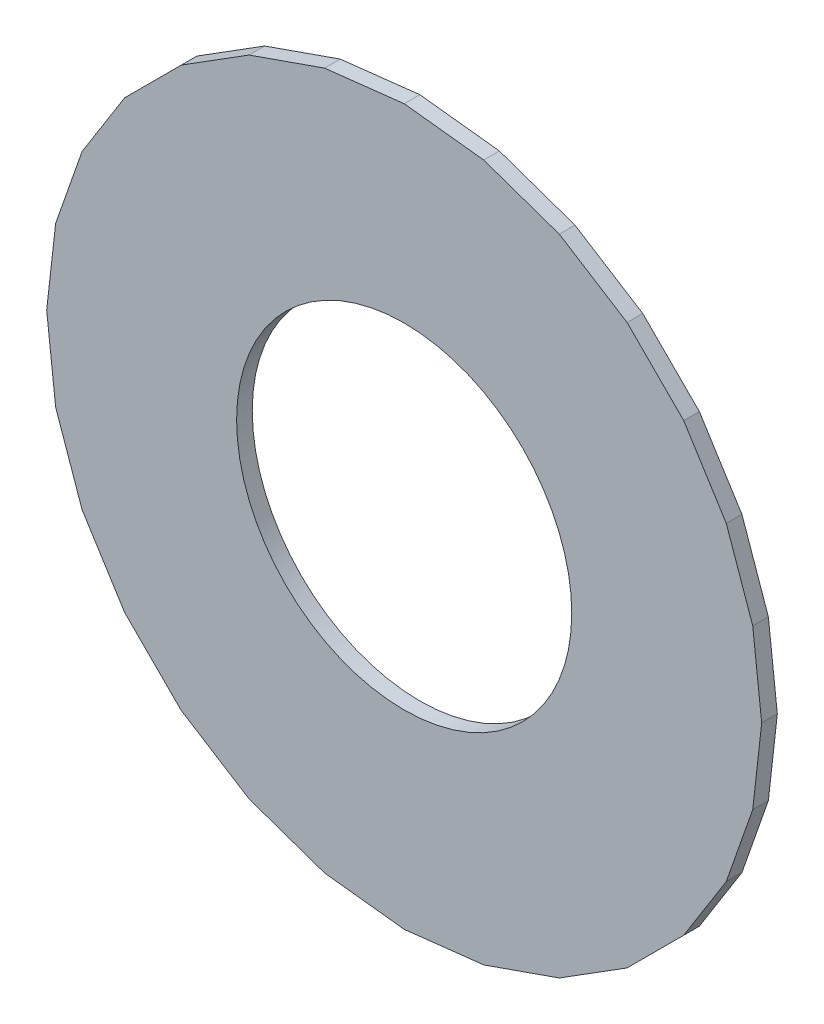
ISO-10303-21;
HEADER;
FILE_DESCRIPTION(('STEP AP214'),'2;1');
FILE_NAME('part.step','',(''),(''),'','','');
FILE_SCHEMA(('AUTOMOTIVE_DESIGN { 1 0 10303 214 1 1 1 1 }'));
ENDSEC;
DATA;
#1=APPLICATION_CONTEXT('core data for automotive mechanical design processes');
#2=APPLICATION_PROTOCOL_DEFINITION('international standard','automotive_design',2000,#1);
#3=PRODUCT_CONTEXT('',#1,'mechanical');
#4=PRODUCT('Part','Part','',(#3));
#5=PRODUCT_RELATED_PRODUCT_CATEGORY('part','',(#4));
#6=PRODUCT_DEFINITION_FORMATION('','',#4);
#7=PRODUCT_DEFINITION_CONTEXT('part definition',#1,'design');
#8=PRODUCT_DEFINITION('design','',#6,#7);
#9=PRODUCT_DEFINITION_SHAPE('','',#8);
#10=(LENGTH_UNIT() NAMED_UNIT(*) SI_UNIT(.MILLI.,.METRE.));
#11=(NAMED_UNIT(*) PLANE_ANGLE_UNIT() SI_UNIT($,.RADIAN.));
#12=(NAMED_UNIT(*) SI_UNIT($,.STERADIAN.) SOLID_ANGLE_UNIT());
#13=UNCERTAINTY_MEASURE_WITH_UNIT(LENGTH_MEASURE(1.E-05),#10,'distance_accuracy_value','');
#14=(GEOMETRIC_REPRESENTATION_CONTEXT(3) GLOBAL_UNCERTAINTY_ASSIGNED_CONTEXT((#13)) GLOBAL_UNIT_ASSIGNED_CONTEXT((#10,
#11,#12)) REPRESENTATION_CONTEXT('',''));
#15=CARTESIAN_POINT('',(0.,0.,0.));
#16=DIRECTION('',(0.,0.,1.));
#17=DIRECTION('',(1.,0.,0.));
#18=AXIS2_PLACEMENT_3D('',#15,#16,#17);
#19=CARTESIAN_POINT('',(166.497,-143.637,-0.045));
#20=DIRECTION('',(0.,0.,-1.));
#21=DIRECTION('',(0.,-1.,0.));
#22=AXIS2_PLACEMENT_3D('',#19,#20,#21);
#23=CYLINDRICAL_SURFACE('',#22,0.375);
#24=CARTESIAN_POINT('',(166.497,-143.637,-0.035));
#25=DIRECTION('',(0.,0.,-1.));
#26=DIRECTION('',(0.,-1.,0.));
#27=AXIS2_PLACEMENT_3D('',#24,#25,#26);
#28=CIRCLE('',#27,0.375);
#29=CARTESIAN_POINT('',(166.497,-144.012,-0.035));
#30=VERTEX_POINT('',#29);
#31=EDGE_CURVE('E403',#30,#30,#28,.T.);
#32=ORIENTED_EDGE('',*,*,#31,.T.);
#33=DIRECTION('',(0.,0.,1.));
#34=VECTOR('',#33,1.);
#35=CARTESIAN_POINT('',(166.497,-144.012,-0.045));
#36=LINE('',#35,#34);
#37=CARTESIAN_POINT('',(166.497,-144.012,0.));
#38=VERTEX_POINT('',#37);
#39=EDGE_CURVE('E11',#30,#38,#36,.T.);
#40=ORIENTED_EDGE('',*,*,#39,.T.);
#41=CARTESIAN_POINT('',(166.497,-143.637,0.));
#42=DIRECTION('',(0.,0.,-1.));
#43=DIRECTION('',(0.,-1.,0.));
#44=AXIS2_PLACEMENT_3D('',#41,#42,#43);
#45=CIRCLE('',#44,0.375);
#46=EDGE_CURVE('E503',#38,#38,#45,.T.);
#47=ORIENTED_EDGE('',*,*,#46,.F.);
#48=ORIENTED_EDGE('',*,*,#39,.F.);
#49=EDGE_LOOP('',(#32,#40,#47,#48));
#50=FACE_BOUND('',#49,.T.);
#51=ADVANCED_FACE('F17',(#50),#23,.F.);
#52=CARTESIAN_POINT('',(166.318983,-144.416942,-0.035));
#53=DIRECTION('',(-0.330278315977027,-0.943883591337077,0.));
#54=DIRECTION('',(-0.943883591337077,0.330278315977027,0.));
#55=AXIS2_PLACEMENT_3D('',#52,#53,#54);
#56=PLANE('',#55);
#57=DIRECTION('',(0.,0.,1.));
#58=VECTOR('',#57,1.);
#59=CARTESIAN_POINT('',(166.318983,-144.416942,-0.035));
#60=LINE('',#59,#58);
#61=CARTESIAN_POINT('',(166.318983,-144.416942,-0.035));
#62=VERTEX_POINT('',#61);
#63=CARTESIAN_POINT('',(166.318983,-144.416942,0.));
#64=VERTEX_POINT('',#63);
#65=EDGE_CURVE('E25',#62,#64,#60,.T.);
#66=ORIENTED_EDGE('',*,*,#65,.T.);
#67=DIRECTION('',(-0.943883591337077,0.330278315977027,0.));
#68=VECTOR('',#67,1.);
#69=CARTESIAN_POINT('',(166.318983,-144.416942,0.));
#70=LINE('',#69,#68);
#71=CARTESIAN_POINT('',(166.149893,-144.357775,0.));
#72=VERTEX_POINT('',#71);
#73=EDGE_CURVE('E471',#64,#72,#70,.T.);
#74=ORIENTED_EDGE('',*,*,#73,.T.);
#75=DIRECTION('',(0.,0.,1.));
#76=VECTOR('',#75,1.);
#77=CARTESIAN_POINT('',(166.149893,-144.357775,-0.035));
#78=LINE('',#77,#76);
#79=CARTESIAN_POINT('',(166.149893,-144.357775,-0.035));
#80=VERTEX_POINT('',#79);
#81=EDGE_CURVE('E535',#80,#72,#78,.T.);
#82=ORIENTED_EDGE('',*,*,#81,.F.);
#83=DIRECTION('',(-0.943883591337077,0.330278315977027,0.));
#84=VECTOR('',#83,1.);
#85=CARTESIAN_POINT('',(166.318983,-144.416942,-0.035));
#86=LINE('',#85,#84);
#87=EDGE_CURVE('E365',#62,#80,#86,.T.);
#88=ORIENTED_EDGE('',*,*,#87,.F.);
#89=EDGE_LOOP('',(#66,#74,#82,#88));
#90=FACE_BOUND('',#89,.T.);
#91=ADVANCED_FACE('F542',(#90),#56,.T.);
#92=CARTESIAN_POINT('',(166.497,-144.437,-0.035));
#93=DIRECTION('',(-0.111966136678988,-0.993712022789894,0.));
#94=DIRECTION('',(-0.993712022789894,0.111966136678988,0.));
#95=AXIS2_PLACEMENT_3D('',#92,#93,#94);
#96=PLANE('',#95);
#97=DIRECTION('',(0.,0.,1.));
#98=VECTOR('',#97,1.);
#99=CARTESIAN_POINT('',(166.497,-144.437,-0.035));
#100=LINE('',#99,#98);
#101=CARTESIAN_POINT('',(166.497,-144.437,-0.035));
#102=VERTEX_POINT('',#101);
#103=CARTESIAN_POINT('',(166.497,-144.437,0.));
#104=VERTEX_POINT('',#103);
#105=EDGE_CURVE('E532',#102,#104,#100,.T.);
#106=ORIENTED_EDGE('',*,*,#105,.T.);
#107=DIRECTION('',(-0.993712022789894,0.111966136678988,0.));
#108=VECTOR('',#107,1.);
#109=CARTESIAN_POINT('',(166.497,-144.437,0.));
#110=LINE('',#109,#108);
#111=EDGE_CURVE('E475',#104,#64,#110,.T.);
#112=ORIENTED_EDGE('',*,*,#111,.T.);
#113=ORIENTED_EDGE('',*,*,#65,.F.);
#114=DIRECTION('',(-0.993712022789894,0.111966136678988,0.));
#115=VECTOR('',#114,1.);
#116=CARTESIAN_POINT('',(166.497,-144.437,-0.035));
#117=LINE('',#116,#115);
#118=EDGE_CURVE('E361',#102,#62,#117,.T.);
#119=ORIENTED_EDGE('',*,*,#118,.F.);
#120=EDGE_LOOP('',(#106,#112,#113,#119));
#121=FACE_BOUND('',#120,.T.);
#122=ADVANCED_FACE('F548',(#121),#96,.T.);
#123=CARTESIAN_POINT('',(166.149893,-144.357775,-0.035));
#124=DIRECTION('',(-0.532032066600227,-0.846724205458361,0.));
#125=DIRECTION('',(-0.846724205458361,0.532032066600227,0.));
#126=AXIS2_PLACEMENT_3D('',#123,#124,#125);
#127=PLANE('',#126);
#128=ORIENTED_EDGE('',*,*,#81,.T.);
#129=DIRECTION('',(-0.846724205458361,0.532032066600227,0.));
#130=VECTOR('',#129,1.);
#131=CARTESIAN_POINT('',(166.149893,-144.357775,0.));
#132=LINE('',#131,#130);
#133=CARTESIAN_POINT('',(165.998208,-144.262465,0.));
#134=VERTEX_POINT('',#133);
#135=EDGE_CURVE('E467',#72,#134,#132,.T.);
#136=ORIENTED_EDGE('',*,*,#135,.T.);
#137=DIRECTION('',(0.,0.,1.));
#138=VECTOR('',#137,1.);
#139=CARTESIAN_POINT('',(165.998208,-144.262465,-0.035));
#140=LINE('',#139,#138);
#141=CARTESIAN_POINT('',(165.998208,-144.262465,-0.035));
#142=VERTEX_POINT('',#141);
#143=EDGE_CURVE('E529',#142,#134,#140,.T.);
#144=ORIENTED_EDGE('',*,*,#143,.F.);
#145=DIRECTION('',(-0.846724205458361,0.532032066600227,0.));
#146=VECTOR('',#145,1.);
#147=CARTESIAN_POINT('',(166.149893,-144.357775,-0.035));
#148=LINE('',#147,#146);
#149=EDGE_CURVE('E372',#80,#142,#148,.T.);
#150=ORIENTED_EDGE('',*,*,#149,.F.);
#151=EDGE_LOOP('',(#128,#136,#144,#150));
#152=FACE_BOUND('',#151,.T.);
#153=ADVANCED_FACE('F557',(#152),#127,.T.);
#154=CARTESIAN_POINT('',(166.675017,-144.416942,-0.035));
#155=DIRECTION('',(0.111966136678988,-0.993712022789894,0.));
#156=DIRECTION('',(0.,0.,-1.));
#157=AXIS2_PLACEMENT_3D('',#154,#155,#156);
#158=PLANE('',#157);
#159=DIRECTION('',(0.,0.,1.));
#160=VECTOR('',#159,1.);
#161=CARTESIAN_POINT('',(166.675017,-144.416942,-0.035));
#162=LINE('',#161,#160);
#163=CARTESIAN_POINT('',(166.675017,-144.416942,-0.035));
#164=VERTEX_POINT('',#163);
#165=CARTESIAN_POINT('',(166.675017,-144.416942,0.));
#166=VERTEX_POINT('',#165);
#167=EDGE_CURVE('E526',#164,#166,#162,.T.);
#168=ORIENTED_EDGE('',*,*,#167,.T.);
#169=DIRECTION('',(-0.993712022789894,-0.111966136678988,0.));
#170=VECTOR('',#169,1.);
#171=CARTESIAN_POINT('',(166.675017,-144.416942,0.));
#172=LINE('',#171,#170);
#173=EDGE_CURVE('E483',#166,#104,#172,.T.);
#174=ORIENTED_EDGE('',*,*,#173,.T.);
#175=ORIENTED_EDGE('',*,*,#105,.F.);
#176=DIRECTION('',(-0.993712022789894,-0.111966136678988,0.));
#177=VECTOR('',#176,1.);
#178=CARTESIAN_POINT('',(166.675017,-144.416942,-0.035));
#179=LINE('',#178,#177);
#180=EDGE_CURVE('E360',#164,#102,#179,.T.);
#181=ORIENTED_EDGE('',*,*,#180,.F.);
#182=EDGE_LOOP('',(#168,#174,#175,#181));
#183=FACE_BOUND('',#182,.T.);
#184=ADVANCED_FACE('F563',(#183),#158,.T.);
#185=CARTESIAN_POINT('',(165.998208,-144.262465,-0.035));
#186=DIRECTION('',(-0.707106781186048,-0.707106781187048,0.));
#187=DIRECTION('',(-0.707106781187048,0.707106781186048,0.));
#188=AXIS2_PLACEMENT_3D('',#185,#186,#187);
#189=PLANE('',#188);
#190=ORIENTED_EDGE('',*,*,#143,.T.);
#191=DIRECTION('',(-0.707106781187048,0.707106781186048,0.));
#192=VECTOR('',#191,1.);
#193=CARTESIAN_POINT('',(165.998208,-144.262465,0.));
#194=LINE('',#193,#192);
#195=CARTESIAN_POINT('',(165.871535,-144.135792,0.));
#196=VERTEX_POINT('',#195);
#197=EDGE_CURVE('E355',#134,#196,#194,.T.);
#198=ORIENTED_EDGE('',*,*,#197,.T.);
#199=DIRECTION('',(0.,0.,1.));
#200=VECTOR('',#199,1.);
#201=CARTESIAN_POINT('',(165.871535,-144.135792,-0.035));
#202=LINE('',#201,#200);
#203=CARTESIAN_POINT('',(165.871535,-144.135792,-0.035));
#204=VERTEX_POINT('',#203);
#205=EDGE_CURVE('E479',#204,#196,#202,.T.);
#206=ORIENTED_EDGE('',*,*,#205,.F.);
#207=DIRECTION('',(-0.707106781187048,0.707106781186048,0.));
#208=VECTOR('',#207,1.);
#209=CARTESIAN_POINT('',(165.998208,-144.262465,-0.035));
#210=LINE('',#209,#208);
#211=EDGE_CURVE('E376',#142,#204,#210,.T.);
#212=ORIENTED_EDGE('',*,*,#211,.F.);
#213=EDGE_LOOP('',(#190,#198,#206,#212));
#214=FACE_BOUND('',#213,.T.);
#215=ADVANCED_FACE('F933',(#214),#189,.T.);
#216=CARTESIAN_POINT('',(166.844107,-144.357775,-0.035));
#217=DIRECTION('',(0.330278315977027,-0.943883591337077,0.));
#218=DIRECTION('',(0.,0.,-1.));
#219=AXIS2_PLACEMENT_3D('',#216,#217,#218);
#220=PLANE('',#219);
#221=DIRECTION('',(0.,0.,1.));
#222=VECTOR('',#221,1.);
#223=CARTESIAN_POINT('',(166.844107,-144.357775,-0.035));
#224=LINE('',#223,#222);
#225=CARTESIAN_POINT('',(166.844107,-144.357775,-0.035));
#226=VERTEX_POINT('',#225);
#227=CARTESIAN_POINT('',(166.844107,-144.357775,0.));
#228=VERTEX_POINT('',#227);
#229=EDGE_CURVE('E476',#226,#228,#224,.T.);
#230=ORIENTED_EDGE('',*,*,#229,.T.);
#231=DIRECTION('',(-0.943883591337077,-0.330278315977027,0.));
#232=VECTOR('',#231,1.);
#233=CARTESIAN_POINT('',(166.844107,-144.357775,0.));
#234=LINE('',#233,#232);
#235=EDGE_CURVE('E454',#228,#166,#234,.T.);
#236=ORIENTED_EDGE('',*,*,#235,.T.);
#237=ORIENTED_EDGE('',*,*,#167,.F.);
#238=DIRECTION('',(-0.943883591337077,-0.330278315977027,0.));
#239=VECTOR('',#238,1.);
#240=CARTESIAN_POINT('',(166.844107,-144.357775,-0.035));
#241=LINE('',#240,#239);
#242=EDGE_CURVE('E350',#226,#164,#241,.T.);
#243=ORIENTED_EDGE('',*,*,#242,.F.);
#244=EDGE_LOOP('',(#230,#236,#237,#243));
#245=FACE_BOUND('',#244,.T.);
#246=ADVANCED_FACE('F927',(#245),#220,.T.);
#247=CARTESIAN_POINT('',(165.871535,-144.135792,-0.035));
#248=DIRECTION('',(-0.846724205458361,-0.532032066600227,0.));
#249=DIRECTION('',(-0.532032066600227,0.846724205458361,0.));
#250=AXIS2_PLACEMENT_3D('',#247,#248,#249);
#251=PLANE('',#250);
#252=ORIENTED_EDGE('',*,*,#205,.T.);
#253=DIRECTION('',(-0.532032066600227,0.846724205458361,0.));
#254=VECTOR('',#253,1.);
#255=CARTESIAN_POINT('',(165.871535,-144.135792,0.));
#256=LINE('',#255,#254);
#257=CARTESIAN_POINT('',(165.776225,-143.984107,0.));
#258=VERTEX_POINT('',#257);
#259=EDGE_CURVE('E351',#196,#258,#256,.T.);
#260=ORIENTED_EDGE('',*,*,#259,.T.);
#261=DIRECTION('',(0.,0.,1.));
#262=VECTOR('',#261,1.);
#263=CARTESIAN_POINT('',(165.776225,-143.984107,-0.035));
#264=LINE('',#263,#262);
#265=CARTESIAN_POINT('',(165.776225,-143.984107,-0.035));
#266=VERTEX_POINT('',#265);
#267=EDGE_CURVE('E427',#266,#258,#264,.T.);
#268=ORIENTED_EDGE('',*,*,#267,.F.);
#269=DIRECTION('',(-0.532032066600227,0.846724205458361,0.));
#270=VECTOR('',#269,1.);
#271=CARTESIAN_POINT('',(165.871535,-144.135792,-0.035));
#272=LINE('',#271,#270);
#273=EDGE_CURVE('E346',#204,#266,#272,.T.);
#274=ORIENTED_EDGE('',*,*,#273,.F.);
#275=EDGE_LOOP('',(#252,#260,#268,#274));
#276=FACE_BOUND('',#275,.T.);
#277=ADVANCED_FACE('F932',(#276),#251,.T.);
#278=CARTESIAN_POINT('',(166.995792,-144.262465,-0.035));
#279=DIRECTION('',(0.532032066600227,-0.846724205458361,0.));
#280=DIRECTION('',(0.,0.,-1.));
#281=AXIS2_PLACEMENT_3D('',#278,#279,#280);
#282=PLANE('',#281);
#283=DIRECTION('',(0.,0.,1.));
#284=VECTOR('',#283,1.);
#285=CARTESIAN_POINT('',(166.995792,-144.262465,-0.035));
#286=LINE('',#285,#284);
#287=CARTESIAN_POINT('',(166.995792,-144.262465,-0.035));
#288=VERTEX_POINT('',#287);
#289=CARTESIAN_POINT('',(166.995792,-144.262465,0.));
#290=VERTEX_POINT('',#289);
#291=EDGE_CURVE('E424',#288,#290,#286,.T.);
#292=ORIENTED_EDGE('',*,*,#291,.T.);
#293=DIRECTION('',(-0.846724205458361,-0.532032066600227,0.));
#294=VECTOR('',#293,1.);
#295=CARTESIAN_POINT('',(166.995792,-144.262465,0.));
#296=LINE('',#295,#294);
#297=EDGE_CURVE('E449',#290,#228,#296,.T.);
#298=ORIENTED_EDGE('',*,*,#297,.T.);
#299=ORIENTED_EDGE('',*,*,#229,.F.);
#300=DIRECTION('',(-0.846724205458361,-0.532032066600227,0.));
#301=VECTOR('',#300,1.);
#302=CARTESIAN_POINT('',(166.995792,-144.262465,-0.035));
#303=LINE('',#302,#301);
#304=EDGE_CURVE('E331',#288,#226,#303,.T.);
#305=ORIENTED_EDGE('',*,*,#304,.F.);
#306=EDGE_LOOP('',(#292,#298,#299,#305));
#307=FACE_BOUND('',#306,.T.);
#308=ADVANCED_FACE('F1002',(#307),#282,.T.);
#309=CARTESIAN_POINT('',(165.776225,-143.984107,-0.035));
#310=DIRECTION('',(-0.943883591336766,-0.330278315977918,0.));
#311=DIRECTION('',(-0.330278315977918,0.943883591336766,0.));
#312=AXIS2_PLACEMENT_3D('',#309,#310,#311);
#313=PLANE('',#312);
#314=ORIENTED_EDGE('',*,*,#267,.T.);
#315=DIRECTION('',(-0.330278315977918,0.943883591336766,0.));
#316=VECTOR('',#315,1.);
#317=CARTESIAN_POINT('',(165.776225,-143.984107,0.));
#318=LINE('',#317,#316);
#319=CARTESIAN_POINT('',(165.717058,-143.815017,0.));
#320=VERTEX_POINT('',#319);
#321=EDGE_CURVE('E356',#258,#320,#318,.T.);
#322=ORIENTED_EDGE('',*,*,#321,.T.);
#323=DIRECTION('',(0.,0.,1.));
#324=VECTOR('',#323,1.);
#325=CARTESIAN_POINT('',(165.717058,-143.815017,-0.035));
#326=LINE('',#325,#324);
#327=CARTESIAN_POINT('',(165.717058,-143.815017,-0.035));
#328=VERTEX_POINT('',#327);
#329=EDGE_CURVE('E335',#328,#320,#326,.T.);
#330=ORIENTED_EDGE('',*,*,#329,.F.);
#331=DIRECTION('',(-0.330278315977918,0.943883591336766,0.));
#332=VECTOR('',#331,1.);
#333=CARTESIAN_POINT('',(165.776225,-143.984107,-0.035));
#334=LINE('',#333,#332);
#335=EDGE_CURVE('E342',#266,#328,#334,.T.);
#336=ORIENTED_EDGE('',*,*,#335,.F.);
#337=EDGE_LOOP('',(#314,#322,#330,#336));
#338=FACE_BOUND('',#337,.T.);
#339=ADVANCED_FACE('F604',(#338),#313,.T.);
#340=CARTESIAN_POINT('',(167.122465,-144.135792,-0.035));
#341=DIRECTION('',(0.707106781186048,-0.707106781187048,0.));
#342=DIRECTION('',(0.,0.,-1.));
#343=AXIS2_PLACEMENT_3D('',#340,#341,#342);
#344=PLANE('',#343);
#345=DIRECTION('',(0.,0.,1.));
#346=VECTOR('',#345,1.);
#347=CARTESIAN_POINT('',(167.122465,-144.135792,-0.035));
#348=LINE('',#347,#346);
#349=CARTESIAN_POINT('',(167.122465,-144.135792,-0.035));
#350=VERTEX_POINT('',#349);
#351=CARTESIAN_POINT('',(167.122465,-144.135792,0.));
#352=VERTEX_POINT('',#351);
#353=EDGE_CURVE('E332',#350,#352,#348,.T.);
#354=ORIENTED_EDGE('',*,*,#353,.T.);
#355=DIRECTION('',(-0.707106781187048,-0.707106781186048,0.));
#356=VECTOR('',#355,1.);
#357=CARTESIAN_POINT('',(167.122465,-144.135792,0.));
#358=LINE('',#357,#356);
#359=EDGE_CURVE('E453',#352,#290,#358,.T.);
#360=ORIENTED_EDGE('',*,*,#359,.T.);
#361=ORIENTED_EDGE('',*,*,#291,.F.);
#362=DIRECTION('',(-0.707106781187048,-0.707106781186048,0.));
#363=VECTOR('',#362,1.);
#364=CARTESIAN_POINT('',(167.122465,-144.135792,-0.035));
#365=LINE('',#364,#363);
#366=EDGE_CURVE('E327',#350,#288,#365,.T.);
#367=ORIENTED_EDGE('',*,*,#366,.F.);
#368=EDGE_LOOP('',(#354,#360,#361,#367));
#369=FACE_BOUND('',#368,.T.);
#370=ADVANCED_FACE('F986',(#369),#344,.T.);
#371=CARTESIAN_POINT('',(165.717058,-143.815017,-0.035));
#372=DIRECTION('',(-0.993712022789894,-0.111966136678988,0.));
#373=DIRECTION('',(-0.111966136678988,0.993712022789894,0.));
#374=AXIS2_PLACEMENT_3D('',#371,#372,#373);
#375=PLANE('',#374);
#376=ORIENTED_EDGE('',*,*,#329,.T.);
#377=DIRECTION('',(-0.111966136678988,0.993712022789894,0.));
#378=VECTOR('',#377,1.);
#379=CARTESIAN_POINT('',(165.717058,-143.815017,0.));
#380=LINE('',#379,#378);
#381=CARTESIAN_POINT('',(165.697,-143.637,0.));
#382=VERTEX_POINT('',#381);
#383=EDGE_CURVE('E443',#320,#382,#380,.T.);
#384=ORIENTED_EDGE('',*,*,#383,.T.);
#385=DIRECTION('',(0.,0.,1.));
#386=VECTOR('',#385,1.);
#387=CARTESIAN_POINT('',(165.697,-143.637,-0.035));
#388=LINE('',#387,#386);
#389=CARTESIAN_POINT('',(165.697,-143.637,-0.035));
#390=VERTEX_POINT('',#389);
#391=EDGE_CURVE('E336',#390,#382,#388,.T.);
#392=ORIENTED_EDGE('',*,*,#391,.F.);
#393=DIRECTION('',(-0.111966136678988,0.993712022789894,0.));
#394=VECTOR('',#393,1.);
#395=CARTESIAN_POINT('',(165.717058,-143.815017,-0.035));
#396=LINE('',#395,#394);
#397=EDGE_CURVE('E313',#328,#390,#396,.T.);
#398=ORIENTED_EDGE('',*,*,#397,.F.);
#399=EDGE_LOOP('',(#376,#384,#392,#398));
#400=FACE_BOUND('',#399,.T.);
#401=ADVANCED_FACE('F598',(#400),#375,.T.);
#402=CARTESIAN_POINT('',(167.217775,-143.984107,-0.035));
#403=DIRECTION('',(0.846724205458361,-0.532032066600227,0.));
#404=DIRECTION('',(0.,0.,-1.));
#405=AXIS2_PLACEMENT_3D('',#402,#403,#404);
#406=PLANE('',#405);
#407=DIRECTION('',(0.,0.,1.));
#408=VECTOR('',#407,1.);
#409=CARTESIAN_POINT('',(167.217775,-143.984107,-0.035));
#410=LINE('',#409,#408);
#411=CARTESIAN_POINT('',(167.217775,-143.984107,-0.035));
#412=VERTEX_POINT('',#411);
#413=CARTESIAN_POINT('',(167.217775,-143.984107,0.));
#414=VERTEX_POINT('',#413);
#415=EDGE_CURVE('E442',#412,#414,#410,.T.);
#416=ORIENTED_EDGE('',*,*,#415,.T.);
#417=DIRECTION('',(-0.532032066600227,-0.846724205458361,0.));
#418=VECTOR('',#417,1.);
#419=CARTESIAN_POINT('',(167.217775,-143.984107,0.));
#420=LINE('',#419,#418);
#421=EDGE_CURVE('E463',#414,#352,#420,.T.);
#422=ORIENTED_EDGE('',*,*,#421,.T.);
#423=ORIENTED_EDGE('',*,*,#353,.F.);
#424=DIRECTION('',(-0.532032066600227,-0.846724205458361,0.));
#425=VECTOR('',#424,1.);
#426=CARTESIAN_POINT('',(167.217775,-143.984107,-0.035));
#427=LINE('',#426,#425);
#428=EDGE_CURVE('E323',#412,#350,#427,.T.);
#429=ORIENTED_EDGE('',*,*,#428,.F.);
#430=EDGE_LOOP('',(#416,#422,#423,#429));
#431=FACE_BOUND('',#430,.T.);
#432=ADVANCED_FACE('F970',(#431),#406,.T.);
#433=CARTESIAN_POINT('',(165.697,-143.637,-0.035));
#434=DIRECTION('',(-0.993712022789894,0.111966136678988,0.));
#435=DIRECTION('',(0.,0.,1.));
#436=AXIS2_PLACEMENT_3D('',#433,#434,#435);
#437=PLANE('',#436);
#438=ORIENTED_EDGE('',*,*,#391,.T.);
#439=DIRECTION('',(0.111966136678988,0.993712022789894,0.));
#440=VECTOR('',#439,1.);
#441=CARTESIAN_POINT('',(165.697,-143.637,0.));
#442=LINE('',#441,#440);
#443=CARTESIAN_POINT('',(165.717058,-143.458983,0.));
#444=VERTEX_POINT('',#443);
#445=EDGE_CURVE('E439',#382,#444,#442,.T.);
#446=ORIENTED_EDGE('',*,*,#445,.T.);
#447=DIRECTION('',(0.,0.,1.));
#448=VECTOR('',#447,1.);
#449=CARTESIAN_POINT('',(165.717058,-143.458983,-0.035));
#450=LINE('',#449,#448);
#451=CARTESIAN_POINT('',(165.717058,-143.458983,-0.035));
#452=VERTEX_POINT('',#451);
#453=EDGE_CURVE('E340',#452,#444,#450,.T.);
#454=ORIENTED_EDGE('',*,*,#453,.F.);
#455=DIRECTION('',(0.111966136678988,0.993712022789894,0.));
#456=VECTOR('',#455,1.);
#457=CARTESIAN_POINT('',(165.697,-143.637,-0.035));
#458=LINE('',#457,#456);
#459=EDGE_CURVE('E309',#390,#452,#458,.T.);
#460=ORIENTED_EDGE('',*,*,#459,.F.);
#461=EDGE_LOOP('',(#438,#446,#454,#460));
#462=FACE_BOUND('',#461,.T.);
#463=ADVANCED_FACE('F961',(#462),#437,.T.);
#464=CARTESIAN_POINT('',(167.276942,-143.815017,-0.035));
#465=DIRECTION('',(0.943883591336766,-0.330278315977918,0.));
#466=DIRECTION('',(0.,0.,-1.));
#467=AXIS2_PLACEMENT_3D('',#464,#465,#466);
#468=PLANE('',#467);
#469=DIRECTION('',(0.,0.,1.));
#470=VECTOR('',#469,1.);
#471=CARTESIAN_POINT('',(167.276942,-143.815017,-0.035));
#472=LINE('',#471,#470);
#473=CARTESIAN_POINT('',(167.276942,-143.815017,-0.035));
#474=VERTEX_POINT('',#473);
#475=CARTESIAN_POINT('',(167.276942,-143.815017,0.));
#476=VERTEX_POINT('',#475);
#477=EDGE_CURVE('E337',#474,#476,#472,.T.);
#478=ORIENTED_EDGE('',*,*,#477,.T.);
#479=DIRECTION('',(-0.330278315977918,-0.943883591336766,0.));
#480=VECTOR('',#479,1.);
#481=CARTESIAN_POINT('',(167.276942,-143.815017,0.));
#482=LINE('',#481,#480);
#483=EDGE_CURVE('E458',#476,#414,#482,.T.);
#484=ORIENTED_EDGE('',*,*,#483,.T.);
#485=ORIENTED_EDGE('',*,*,#415,.F.);
#486=DIRECTION('',(-0.330278315977918,-0.943883591336766,0.));
#487=VECTOR('',#486,1.);
#488=CARTESIAN_POINT('',(167.276942,-143.815017,-0.035));
#489=LINE('',#488,#487);
#490=EDGE_CURVE('E319',#474,#412,#489,.T.);
#491=ORIENTED_EDGE('',*,*,#490,.F.);
#492=EDGE_LOOP('',(#478,#484,#485,#491));
#493=FACE_BOUND('',#492,.T.);
#494=ADVANCED_FACE('F943',(#493),#468,.T.);
#495=CARTESIAN_POINT('',(165.717058,-143.458983,-0.035));
#496=DIRECTION('',(-0.943883591336766,0.330278315977918,0.));
#497=DIRECTION('',(0.,0.,1.));
#498=AXIS2_PLACEMENT_3D('',#495,#496,#497);
#499=PLANE('',#498);
#500=ORIENTED_EDGE('',*,*,#453,.T.);
#501=DIRECTION('',(0.330278315977918,0.943883591336766,0.));
#502=VECTOR('',#501,1.);
#503=CARTESIAN_POINT('',(165.717058,-143.458983,0.));
#504=LINE('',#503,#502);
#505=CARTESIAN_POINT('',(165.776225,-143.289893,0.));
#506=VERTEX_POINT('',#505);
#507=EDGE_CURVE('E435',#444,#506,#504,.T.);
#508=ORIENTED_EDGE('',*,*,#507,.T.);
#509=DIRECTION('',(0.,0.,1.));
#510=VECTOR('',#509,1.);
#511=CARTESIAN_POINT('',(165.776225,-143.289893,-0.035));
#512=LINE('',#511,#510);
#513=CARTESIAN_POINT('',(165.776225,-143.289893,-0.035));
#514=VERTEX_POINT('',#513);
#515=EDGE_CURVE('E341',#514,#506,#512,.T.);
#516=ORIENTED_EDGE('',*,*,#515,.F.);
#517=DIRECTION('',(0.330278315977918,0.943883591336766,0.));
#518=VECTOR('',#517,1.);
#519=CARTESIAN_POINT('',(165.717058,-143.458983,-0.035));
#520=LINE('',#519,#518);
#521=EDGE_CURVE('E312',#452,#514,#520,.T.);
#522=ORIENTED_EDGE('',*,*,#521,.F.);
#523=EDGE_LOOP('',(#500,#508,#516,#522));
#524=FACE_BOUND('',#523,.T.);
#525=ADVANCED_FACE('F892',(#524),#499,.T.);
#526=CARTESIAN_POINT('',(167.297,-143.637,-0.035));
#527=DIRECTION('',(0.993712022789894,-0.111966136678988,0.));
#528=DIRECTION('',(0.,0.,-1.));
#529=AXIS2_PLACEMENT_3D('',#526,#527,#528);
#530=PLANE('',#529);
#531=DIRECTION('',(0.,0.,1.));
#532=VECTOR('',#531,1.);
#533=CARTESIAN_POINT('',(167.297,-143.637,-0.035));
#534=LINE('',#533,#532);
#535=CARTESIAN_POINT('',(167.297,-143.637,-0.035));
#536=VERTEX_POINT('',#535);
#537=CARTESIAN_POINT('',(167.297,-143.637,0.));
#538=VERTEX_POINT('',#537);
#539=EDGE_CURVE('E517',#536,#538,#534,.T.);
#540=ORIENTED_EDGE('',*,*,#539,.T.);
#541=DIRECTION('',(-0.111966136678988,-0.993712022789894,0.));
#542=VECTOR('',#541,1.);
#543=CARTESIAN_POINT('',(167.297,-143.637,0.));
#544=LINE('',#543,#542);
#545=EDGE_CURVE('E462',#538,#476,#544,.T.);
#546=ORIENTED_EDGE('',*,*,#545,.T.);
#547=ORIENTED_EDGE('',*,*,#477,.F.);
#548=DIRECTION('',(-0.111966136678988,-0.993712022789894,0.));
#549=VECTOR('',#548,1.);
#550=CARTESIAN_POINT('',(167.297,-143.637,-0.035));
#551=LINE('',#550,#549);
#552=EDGE_CURVE('E318',#536,#474,#551,.T.);
#553=ORIENTED_EDGE('',*,*,#552,.F.);
#554=EDGE_LOOP('',(#540,#546,#547,#553));
#555=FACE_BOUND('',#554,.T.);
#556=ADVANCED_FACE('F886',(#555),#530,.T.);
#557=CARTESIAN_POINT('',(165.776225,-143.289893,-0.035));
#558=DIRECTION('',(-0.846724205458361,0.532032066600227,0.));
#559=DIRECTION('',(0.,0.,1.));
#560=AXIS2_PLACEMENT_3D('',#557,#558,#559);
#561=PLANE('',#560);
#562=ORIENTED_EDGE('',*,*,#515,.T.);
#563=DIRECTION('',(0.532032066600227,0.846724205458361,0.));
#564=VECTOR('',#563,1.);
#565=CARTESIAN_POINT('',(165.776225,-143.289893,0.));
#566=LINE('',#565,#564);
#567=CARTESIAN_POINT('',(165.871535,-143.138208,0.));
#568=VERTEX_POINT('',#567);
#569=EDGE_CURVE('E431',#506,#568,#566,.T.);
#570=ORIENTED_EDGE('',*,*,#569,.T.);
#571=DIRECTION('',(0.,0.,1.));
#572=VECTOR('',#571,1.);
#573=CARTESIAN_POINT('',(165.871535,-143.138208,-0.035));
#574=LINE('',#573,#572);
#575=CARTESIAN_POINT('',(165.871535,-143.138208,-0.035));
#576=VERTEX_POINT('',#575);
#577=EDGE_CURVE('E514',#576,#568,#574,.T.);
#578=ORIENTED_EDGE('',*,*,#577,.F.);
#579=DIRECTION('',(0.532032066600227,0.846724205458361,0.));
#580=VECTOR('',#579,1.);
#581=CARTESIAN_POINT('',(165.776225,-143.289893,-0.035));
#582=LINE('',#581,#580);
#583=EDGE_CURVE('E386',#514,#576,#582,.T.);
#584=ORIENTED_EDGE('',*,*,#583,.F.);
#585=EDGE_LOOP('',(#562,#570,#578,#584));
#586=FACE_BOUND('',#585,.T.);
#587=ADVANCED_FACE('F891',(#586),#561,.T.);
#588=CARTESIAN_POINT('',(167.276942,-143.458983,-0.035));
#589=DIRECTION('',(0.993712022789894,0.111966136678988,0.));
#590=DIRECTION('',(0.,0.,-1.));
#591=AXIS2_PLACEMENT_3D('',#588,#589,#590);
#592=PLANE('',#591);
#593=DIRECTION('',(0.,0.,1.));
#594=VECTOR('',#593,1.);
#595=CARTESIAN_POINT('',(167.276942,-143.458983,-0.035));
#596=LINE('',#595,#594);
#597=CARTESIAN_POINT('',(167.276942,-143.458983,-0.035));
#598=VERTEX_POINT('',#597);
#599=CARTESIAN_POINT('',(167.276942,-143.458983,0.));
#600=VERTEX_POINT('',#599);
#601=EDGE_CURVE('E511',#598,#600,#596,.T.);
#602=ORIENTED_EDGE('',*,*,#601,.T.);
#603=DIRECTION('',(0.111966136678988,-0.993712022789894,0.));
#604=VECTOR('',#603,1.);
#605=CARTESIAN_POINT('',(167.276942,-143.458983,0.));
#606=LINE('',#605,#604);
#607=EDGE_CURVE('E412',#600,#538,#606,.T.);
#608=ORIENTED_EDGE('',*,*,#607,.T.);
#609=ORIENTED_EDGE('',*,*,#539,.F.);
#610=DIRECTION('',(0.111966136678988,-0.993712022789894,0.));
#611=VECTOR('',#610,1.);
#612=CARTESIAN_POINT('',(167.276942,-143.458983,-0.035));
#613=LINE('',#612,#611);
#614=EDGE_CURVE('E308',#598,#536,#613,.T.);
#615=ORIENTED_EDGE('',*,*,#614,.F.);
#616=EDGE_LOOP('',(#602,#608,#609,#615));
#617=FACE_BOUND('',#616,.T.);
#618=ADVANCED_FACE('F834',(#617),#592,.T.);
#619=CARTESIAN_POINT('',(165.871535,-143.138208,-0.035));
#620=DIRECTION('',(-0.707106781186048,0.707106781187048,0.));
#621=DIRECTION('',(0.,0.,1.));
#622=AXIS2_PLACEMENT_3D('',#619,#620,#621);
#623=PLANE('',#622);
#624=ORIENTED_EDGE('',*,*,#577,.T.);
#625=DIRECTION('',(0.707106781187048,0.707106781186048,0.));
#626=VECTOR('',#625,1.);
#627=CARTESIAN_POINT('',(165.871535,-143.138208,0.));
#628=LINE('',#627,#626);
#629=CARTESIAN_POINT('',(165.998208,-143.011535,0.));
#630=VERTEX_POINT('',#629);
#631=EDGE_CURVE('E423',#568,#630,#628,.T.);
#632=ORIENTED_EDGE('',*,*,#631,.T.);
#633=DIRECTION('',(0.,0.,1.));
#634=VECTOR('',#633,1.);
#635=CARTESIAN_POINT('',(165.998208,-143.011535,-0.035));
#636=LINE('',#635,#634);
#637=CARTESIAN_POINT('',(165.998208,-143.011535,-0.035));
#638=VERTEX_POINT('',#637);
#639=EDGE_CURVE('E510',#638,#630,#636,.T.);
#640=ORIENTED_EDGE('',*,*,#639,.F.);
#641=DIRECTION('',(0.707106781187048,0.707106781186048,0.));
#642=VECTOR('',#641,1.);
#643=CARTESIAN_POINT('',(165.871535,-143.138208,-0.035));
#644=LINE('',#643,#642);
#645=EDGE_CURVE('E390',#576,#638,#644,.T.);
#646=ORIENTED_EDGE('',*,*,#645,.F.);
#647=EDGE_LOOP('',(#624,#632,#640,#646));
#648=FACE_BOUND('',#647,.T.);
#649=ADVANCED_FACE('F828',(#648),#623,.T.);
#650=CARTESIAN_POINT('',(167.217775,-143.289893,-0.035));
#651=DIRECTION('',(0.943883591336766,0.330278315977918,0.));
#652=DIRECTION('',(0.,0.,-1.));
#653=AXIS2_PLACEMENT_3D('',#650,#651,#652);
#654=PLANE('',#653);
#655=DIRECTION('',(0.,0.,1.));
#656=VECTOR('',#655,1.);
#657=CARTESIAN_POINT('',(167.217775,-143.289893,-0.035));
#658=LINE('',#657,#656);
#659=CARTESIAN_POINT('',(167.217775,-143.289893,-0.035));
#660=VERTEX_POINT('',#659);
#661=CARTESIAN_POINT('',(167.217775,-143.289893,0.));
#662=VERTEX_POINT('',#661);
#663=EDGE_CURVE('E284',#660,#662,#658,.T.);
#664=ORIENTED_EDGE('',*,*,#663,.T.);
#665=DIRECTION('',(0.330278315977918,-0.943883591336766,0.));
#666=VECTOR('',#665,1.);
#667=CARTESIAN_POINT('',(167.217775,-143.289893,0.));
#668=LINE('',#667,#666);
#669=EDGE_CURVE('E407',#662,#600,#668,.T.);
#670=ORIENTED_EDGE('',*,*,#669,.T.);
#671=ORIENTED_EDGE('',*,*,#601,.F.);
#672=DIRECTION('',(0.330278315977918,-0.943883591336766,0.));
#673=VECTOR('',#672,1.);
#674=CARTESIAN_POINT('',(167.217775,-143.289893,-0.035));
#675=LINE('',#674,#673);
#676=EDGE_CURVE('E289',#660,#598,#675,.T.);
#677=ORIENTED_EDGE('',*,*,#676,.F.);
#678=EDGE_LOOP('',(#664,#670,#671,#677));
#679=FACE_BOUND('',#678,.T.);
#680=ADVANCED_FACE('F833',(#679),#654,.T.);
#681=CARTESIAN_POINT('',(165.998208,-143.011535,-0.035));
#682=DIRECTION('',(-0.532032066600227,0.846724205458361,0.));
#683=DIRECTION('',(0.,0.,1.));
#684=AXIS2_PLACEMENT_3D('',#681,#682,#683);
#685=PLANE('',#684);
#686=ORIENTED_EDGE('',*,*,#639,.T.);
#687=DIRECTION('',(0.846724205458361,0.532032066600227,0.));
#688=VECTOR('',#687,1.);
#689=CARTESIAN_POINT('',(165.998208,-143.011535,0.));
#690=LINE('',#689,#688);
#691=CARTESIAN_POINT('',(166.149893,-142.916225,0.));
#692=VERTEX_POINT('',#691);
#693=EDGE_CURVE('E419',#630,#692,#690,.T.);
#694=ORIENTED_EDGE('',*,*,#693,.T.);
#695=DIRECTION('',(0.,0.,1.));
#696=VECTOR('',#695,1.);
#697=CARTESIAN_POINT('',(166.149893,-142.916225,-0.035));
#698=LINE('',#697,#696);
#699=CARTESIAN_POINT('',(166.149893,-142.916225,-0.035));
#700=VERTEX_POINT('',#699);
#701=EDGE_CURVE('E278',#700,#692,#698,.T.);
#702=ORIENTED_EDGE('',*,*,#701,.F.);
#703=DIRECTION('',(0.846724205458361,0.532032066600227,0.));
#704=VECTOR('',#703,1.);
#705=CARTESIAN_POINT('',(165.998208,-143.011535,-0.035));
#706=LINE('',#705,#704);
#707=EDGE_CURVE('E394',#638,#700,#706,.T.);
#708=ORIENTED_EDGE('',*,*,#707,.F.);
#709=EDGE_LOOP('',(#686,#694,#702,#708));
#710=FACE_BOUND('',#709,.T.);
#711=ADVANCED_FACE('F881',(#710),#685,.T.);
#712=CARTESIAN_POINT('',(167.122465,-143.138208,-0.035));
#713=DIRECTION('',(0.846724205458361,0.532032066600227,0.));
#714=DIRECTION('',(0.,0.,-1.));
#715=AXIS2_PLACEMENT_3D('',#712,#713,#714);
#716=PLANE('',#715);
#717=DIRECTION('',(0.,0.,1.));
#718=VECTOR('',#717,1.);
#719=CARTESIAN_POINT('',(167.122465,-143.138208,-0.035));
#720=LINE('',#719,#718);
#721=CARTESIAN_POINT('',(167.122465,-143.138208,-0.035));
#722=VERTEX_POINT('',#721);
#723=CARTESIAN_POINT('',(167.122465,-143.138208,0.));
#724=VERTEX_POINT('',#723);
#725=EDGE_CURVE('E45',#722,#724,#720,.T.);
#726=ORIENTED_EDGE('',*,*,#725,.T.);
#727=DIRECTION('',(0.532032066600227,-0.846724205458361,0.));
#728=VECTOR('',#727,1.);
#729=CARTESIAN_POINT('',(167.122465,-143.138208,0.));
#730=LINE('',#729,#728);
#731=EDGE_CURVE('E411',#724,#662,#730,.T.);
#732=ORIENTED_EDGE('',*,*,#731,.T.);
#733=ORIENTED_EDGE('',*,*,#663,.F.);
#734=DIRECTION('',(0.532032066600227,-0.846724205458361,0.));
#735=VECTOR('',#734,1.);
#736=CARTESIAN_POINT('',(167.122465,-143.138208,-0.035));
#737=LINE('',#736,#735);
#738=EDGE_CURVE('E282',#722,#660,#737,.T.);
#739=ORIENTED_EDGE('',*,*,#738,.F.);
#740=EDGE_LOOP('',(#726,#732,#733,#739));
#741=FACE_BOUND('',#740,.T.);
#742=ADVANCED_FACE('F283',(#741),#716,.T.);
#743=CARTESIAN_POINT('',(166.149893,-142.916225,-0.035));
#744=DIRECTION('',(-0.330278315977027,0.943883591337077,0.));
#745=DIRECTION('',(0.,0.,1.));
#746=AXIS2_PLACEMENT_3D('',#743,#744,#745);
#747=PLANE('',#746);
#748=ORIENTED_EDGE('',*,*,#701,.T.);
#749=DIRECTION('',(0.943883591337077,0.330278315977027,0.));
#750=VECTOR('',#749,1.);
#751=CARTESIAN_POINT('',(166.149893,-142.916225,0.));
#752=LINE('',#751,#750);
#753=CARTESIAN_POINT('',(166.318983,-142.857058,0.));
#754=VERTEX_POINT('',#753);
#755=EDGE_CURVE('E415',#692,#754,#752,.T.);
#756=ORIENTED_EDGE('',*,*,#755,.T.);
#757=DIRECTION('',(0.,0.,1.));
#758=VECTOR('',#757,1.);
#759=CARTESIAN_POINT('',(166.318983,-142.857058,-0.035));
#760=LINE('',#759,#758);
#761=CARTESIAN_POINT('',(166.318983,-142.857058,-0.035));
#762=VERTEX_POINT('',#761);
#763=EDGE_CURVE('E279',#762,#754,#760,.T.);
#764=ORIENTED_EDGE('',*,*,#763,.F.);
#765=DIRECTION('',(0.943883591337077,0.330278315977027,0.));
#766=VECTOR('',#765,1.);
#767=CARTESIAN_POINT('',(166.149893,-142.916225,-0.035));
#768=LINE('',#767,#766);
#769=EDGE_CURVE('E398',#700,#762,#768,.T.);
#770=ORIENTED_EDGE('',*,*,#769,.F.);
#771=EDGE_LOOP('',(#748,#756,#764,#770));
#772=FACE_BOUND('',#771,.T.);
#773=ADVANCED_FACE('F806',(#772),#747,.T.);
#774=CARTESIAN_POINT('',(166.995792,-143.011535,-0.035));
#775=DIRECTION('',(0.707106781186048,0.707106781187048,0.));
#776=DIRECTION('',(0.,0.,-1.));
#777=AXIS2_PLACEMENT_3D('',#774,#775,#776);
#778=PLANE('',#777);
#779=DIRECTION('',(0.,0.,1.));
#780=VECTOR('',#779,1.);
#781=CARTESIAN_POINT('',(166.995792,-143.011535,-0.035));
#782=LINE('',#781,#780);
#783=CARTESIAN_POINT('',(166.995792,-143.011535,-0.035));
#784=VERTEX_POINT('',#783);
#785=CARTESIAN_POINT('',(166.995792,-143.011535,0.));
#786=VERTEX_POINT('',#785);
#787=EDGE_CURVE('E301',#784,#786,#782,.T.);
#788=ORIENTED_EDGE('',*,*,#787,.T.);
#789=DIRECTION('',(0.707106781187048,-0.707106781186048,0.));
#790=VECTOR('',#789,1.);
#791=CARTESIAN_POINT('',(166.995792,-143.011535,0.));
#792=LINE('',#791,#790);
#793=EDGE_CURVE('E275',#786,#724,#792,.T.);
#794=ORIENTED_EDGE('',*,*,#793,.T.);
#795=ORIENTED_EDGE('',*,*,#725,.F.);
#796=DIRECTION('',(0.707106781187048,-0.707106781186048,0.));
#797=VECTOR('',#796,1.);
#798=CARTESIAN_POINT('',(166.995792,-143.011535,-0.035));
#799=LINE('',#798,#797);
#800=EDGE_CURVE('E273',#784,#722,#799,.T.);
#801=ORIENTED_EDGE('',*,*,#800,.F.);
#802=EDGE_LOOP('',(#788,#794,#795,#801));
#803=FACE_BOUND('',#802,.T.);
#804=ADVANCED_FACE('F271',(#803),#778,.T.);
#805=CARTESIAN_POINT('',(166.318983,-142.857058,-0.035));
#806=DIRECTION('',(-0.111966136678988,0.993712022789894,0.));
#807=DIRECTION('',(0.,0.,1.));
#808=AXIS2_PLACEMENT_3D('',#805,#806,#807);
#809=PLANE('',#808);
#810=ORIENTED_EDGE('',*,*,#763,.T.);
#811=DIRECTION('',(0.993712022789894,0.111966136678988,0.));
#812=VECTOR('',#811,1.);
#813=CARTESIAN_POINT('',(166.318983,-142.857058,0.));
#814=LINE('',#813,#812);
#815=CARTESIAN_POINT('',(166.497,-142.837,0.));
#816=VERTEX_POINT('',#815);
#817=EDGE_CURVE('E406',#754,#816,#814,.T.);
#818=ORIENTED_EDGE('',*,*,#817,.T.);
#819=DIRECTION('',(0.,0.,1.));
#820=VECTOR('',#819,1.);
#821=CARTESIAN_POINT('',(166.497,-142.837,-0.035));
#822=LINE('',#821,#820);
#823=CARTESIAN_POINT('',(166.497,-142.837,-0.035));
#824=VERTEX_POINT('',#823);
#825=EDGE_CURVE('E575',#824,#816,#822,.T.);
#826=ORIENTED_EDGE('',*,*,#825,.F.);
#827=DIRECTION('',(0.993712022789894,0.111966136678988,0.));
#828=VECTOR('',#827,1.);
#829=CARTESIAN_POINT('',(166.318983,-142.857058,-0.035));
#830=LINE('',#829,#828);
#831=EDGE_CURVE('E402',#762,#824,#830,.T.);
#832=ORIENTED_EDGE('',*,*,#831,.F.);
#833=EDGE_LOOP('',(#810,#818,#826,#832));
#834=FACE_BOUND('',#833,.T.);
#835=ADVANCED_FACE('F805',(#834),#809,.T.);
#836=CARTESIAN_POINT('',(0.,0.,0.));
#837=DIRECTION('',(0.,0.,1.));
#838=DIRECTION('',(1.,0.,0.));
#839=AXIS2_PLACEMENT_3D('',#836,#837,#838);
#840=PLANE('',#839);
#841=ORIENTED_EDGE('',*,*,#46,.T.);
#842=EDGE_LOOP('',(#841));
#843=FACE_BOUND('',#842,.T.);
#844=DIRECTION('',(0.943883591337077,-0.330278315977027,0.));
#845=VECTOR('',#844,1.);
#846=CARTESIAN_POINT('',(166.675017,-142.857058,0.));
#847=LINE('',#846,#845);
#848=CARTESIAN_POINT('',(166.675017,-142.857058,0.));
#849=VERTEX_POINT('',#848);
#850=CARTESIAN_POINT('',(166.844107,-142.916225,0.));
#851=VERTEX_POINT('',#850);
#852=EDGE_CURVE('E615',#849,#851,#847,.T.);
#853=ORIENTED_EDGE('',*,*,#852,.F.);
#854=DIRECTION('',(0.993712022789894,-0.111966136678988,0.));
#855=VECTOR('',#854,1.);
#856=CARTESIAN_POINT('',(166.497,-142.837,0.));
#857=LINE('',#856,#855);
#858=EDGE_CURVE('E579',#816,#849,#857,.T.);
#859=ORIENTED_EDGE('',*,*,#858,.F.);
#860=ORIENTED_EDGE('',*,*,#817,.F.);
#861=ORIENTED_EDGE('',*,*,#755,.F.);
#862=ORIENTED_EDGE('',*,*,#693,.F.);
#863=ORIENTED_EDGE('',*,*,#631,.F.);
#864=ORIENTED_EDGE('',*,*,#569,.F.);
#865=ORIENTED_EDGE('',*,*,#507,.F.);
#866=ORIENTED_EDGE('',*,*,#445,.F.);
#867=ORIENTED_EDGE('',*,*,#383,.F.);
#868=ORIENTED_EDGE('',*,*,#321,.F.);
#869=ORIENTED_EDGE('',*,*,#259,.F.);
#870=ORIENTED_EDGE('',*,*,#197,.F.);
#871=ORIENTED_EDGE('',*,*,#135,.F.);
#872=ORIENTED_EDGE('',*,*,#73,.F.);
#873=ORIENTED_EDGE('',*,*,#111,.F.);
#874=ORIENTED_EDGE('',*,*,#173,.F.);
#875=ORIENTED_EDGE('',*,*,#235,.F.);
#876=ORIENTED_EDGE('',*,*,#297,.F.);
#877=ORIENTED_EDGE('',*,*,#359,.F.);
#878=ORIENTED_EDGE('',*,*,#421,.F.);
#879=ORIENTED_EDGE('',*,*,#483,.F.);
#880=ORIENTED_EDGE('',*,*,#545,.F.);
#881=ORIENTED_EDGE('',*,*,#607,.F.);
#882=ORIENTED_EDGE('',*,*,#669,.F.);
#883=ORIENTED_EDGE('',*,*,#731,.F.);
#884=ORIENTED_EDGE('',*,*,#793,.F.);
#885=DIRECTION('',(0.846724205458361,-0.532032066600227,0.));
#886=VECTOR('',#885,1.);
#887=CARTESIAN_POINT('',(166.844107,-142.916225,0.));
#888=LINE('',#887,#886);
#889=EDGE_CURVE('E587',#851,#786,#888,.T.);
#890=ORIENTED_EDGE('',*,*,#889,.F.);
#891=EDGE_LOOP('',(#853,#859,#860,#861,#862,#863,#864,#865,#866,#867,#868,#869,#870,#871,#872,
#873,#874,#875,#876,#877,#878,#879,#880,#881,#882,#883,#884,#890));
#892=FACE_BOUND('',#891,.T.);
#893=ADVANCED_FACE('F553',(#843,#892),#840,.T.);
#894=CARTESIAN_POINT('',(0.,0.,-0.035));
#895=DIRECTION('',(0.,0.,1.));
#896=DIRECTION('',(1.,0.,0.));
#897=AXIS2_PLACEMENT_3D('',#894,#895,#896);
#898=PLANE('',#897);
#899=ORIENTED_EDGE('',*,*,#31,.F.);
#900=EDGE_LOOP('',(#899));
#901=FACE_BOUND('',#900,.T.);
#902=DIRECTION('',(0.846724205458361,-0.532032066600227,0.));
#903=VECTOR('',#902,1.);
#904=CARTESIAN_POINT('',(166.844107,-142.916225,-0.035));
#905=LINE('',#904,#903);
#906=CARTESIAN_POINT('',(166.844107,-142.916225,-0.035));
#907=VERTEX_POINT('',#906);
#908=EDGE_CURVE('E293',#907,#784,#905,.T.);
#909=ORIENTED_EDGE('',*,*,#908,.T.);
#910=ORIENTED_EDGE('',*,*,#800,.T.);
#911=ORIENTED_EDGE('',*,*,#738,.T.);
#912=ORIENTED_EDGE('',*,*,#676,.T.);
#913=ORIENTED_EDGE('',*,*,#614,.T.);
#914=ORIENTED_EDGE('',*,*,#552,.T.);
#915=ORIENTED_EDGE('',*,*,#490,.T.);
#916=ORIENTED_EDGE('',*,*,#428,.T.);
#917=ORIENTED_EDGE('',*,*,#366,.T.);
#918=ORIENTED_EDGE('',*,*,#304,.T.);
#919=ORIENTED_EDGE('',*,*,#242,.T.);
#920=ORIENTED_EDGE('',*,*,#180,.T.);
#921=ORIENTED_EDGE('',*,*,#118,.T.);
#922=ORIENTED_EDGE('',*,*,#87,.T.);
#923=ORIENTED_EDGE('',*,*,#149,.T.);
#924=ORIENTED_EDGE('',*,*,#211,.T.);
#925=ORIENTED_EDGE('',*,*,#273,.T.);
#926=ORIENTED_EDGE('',*,*,#335,.T.);
#927=ORIENTED_EDGE('',*,*,#397,.T.);
#928=ORIENTED_EDGE('',*,*,#459,.T.);
#929=ORIENTED_EDGE('',*,*,#521,.T.);
#930=ORIENTED_EDGE('',*,*,#583,.T.);
#931=ORIENTED_EDGE('',*,*,#645,.T.);
#932=ORIENTED_EDGE('',*,*,#707,.T.);
#933=ORIENTED_EDGE('',*,*,#769,.T.);
#934=ORIENTED_EDGE('',*,*,#831,.T.);
#935=DIRECTION('',(0.993712022789894,-0.111966136678988,0.));
#936=VECTOR('',#935,1.);
#937=CARTESIAN_POINT('',(166.497,-142.837,-0.035));
#938=LINE('',#937,#936);
#939=CARTESIAN_POINT('',(166.675017,-142.857058,-0.035));
#940=VERTEX_POINT('',#939);
#941=EDGE_CURVE('E582',#824,#940,#938,.T.);
#942=ORIENTED_EDGE('',*,*,#941,.T.);
#943=DIRECTION('',(0.943883591337077,-0.330278315977027,0.));
#944=VECTOR('',#943,1.);
#945=CARTESIAN_POINT('',(166.675017,-142.857058,-0.035));
#946=LINE('',#945,#944);
#947=EDGE_CURVE('E571',#940,#907,#946,.T.);
#948=ORIENTED_EDGE('',*,*,#947,.T.);
#949=EDGE_LOOP('',(#909,#910,#911,#912,#913,#914,#915,#916,#917,#918,#919,#920,#921,#922,#923,
#924,#925,#926,#927,#928,#929,#930,#931,#932,#933,#934,#942,#948));
#950=FACE_BOUND('',#949,.T.);
#951=ADVANCED_FACE('F291',(#901,#950),#898,.F.);
#952=CARTESIAN_POINT('',(166.844107,-142.916225,-0.035));
#953=DIRECTION('',(0.532032066600227,0.846724205458361,0.));
#954=DIRECTION('',(0.,0.,-1.));
#955=AXIS2_PLACEMENT_3D('',#952,#953,#954);
#956=PLANE('',#955);
#957=DIRECTION('',(0.,0.,1.));
#958=VECTOR('',#957,1.);
#959=CARTESIAN_POINT('',(166.844107,-142.916225,-0.035));
#960=LINE('',#959,#958);
#961=EDGE_CURVE('E619',#907,#851,#960,.T.);
#962=ORIENTED_EDGE('',*,*,#961,.T.);
#963=ORIENTED_EDGE('',*,*,#889,.T.);
#964=ORIENTED_EDGE('',*,*,#787,.F.);
#965=ORIENTED_EDGE('',*,*,#908,.F.);
#966=EDGE_LOOP('',(#962,#963,#964,#965));
#967=FACE_BOUND('',#966,.T.);
#968=ADVANCED_FACE('F645',(#967),#956,.T.);
#969=CARTESIAN_POINT('',(166.497,-142.837,-0.035));
#970=DIRECTION('',(0.111966136678988,0.993712022789894,0.));
#971=DIRECTION('',(0.,0.,-1.));
#972=AXIS2_PLACEMENT_3D('',#969,#970,#971);
#973=PLANE('',#972);
#974=ORIENTED_EDGE('',*,*,#825,.T.);
#975=ORIENTED_EDGE('',*,*,#858,.T.);
#976=DIRECTION('',(0.,0.,1.));
#977=VECTOR('',#976,1.);
#978=CARTESIAN_POINT('',(166.675017,-142.857058,-0.035));
#979=LINE('',#978,#977);
#980=EDGE_CURVE('E620',#940,#849,#979,.T.);
#981=ORIENTED_EDGE('',*,*,#980,.F.);
#982=ORIENTED_EDGE('',*,*,#941,.F.);
#983=EDGE_LOOP('',(#974,#975,#981,#982));
#984=FACE_BOUND('',#983,.T.);
#985=ADVANCED_FACE('F815',(#984),#973,.T.);
#986=CARTESIAN_POINT('',(166.675017,-142.857058,-0.035));
#987=DIRECTION('',(0.330278315977027,0.943883591337077,0.));
#988=DIRECTION('',(0.,0.,-1.));
#989=AXIS2_PLACEMENT_3D('',#986,#987,#988);
#990=PLANE('',#989);
#991=ORIENTED_EDGE('',*,*,#980,.T.);
#992=ORIENTED_EDGE('',*,*,#852,.T.);
#993=ORIENTED_EDGE('',*,*,#961,.F.);
#994=ORIENTED_EDGE('',*,*,#947,.F.);
#995=EDGE_LOOP('',(#991,#992,#993,#994));
#996=FACE_BOUND('',#995,.T.);
#997=ADVANCED_FACE('F642',(#996),#990,.T.);
#998=CLOSED_SHELL('',(#51,#91,#122,#153,#184,#215,#246,#277,#308,#339,#370,#401,#432,#463,#494,
#525,#556,#587,#618,#649,#680,#711,#742,#773,#804,#835,#893,#951,#968,#985,#997));
#999=MANIFOLD_SOLID_BREP('B1',#998);
#1000=ADVANCED_BREP_SHAPE_REPRESENTATION('',(#18,#999),#14);
#1001=SHAPE_DEFINITION_REPRESENTATION(#9,#1000);
ENDSEC;
END-ISO-10303-21;
